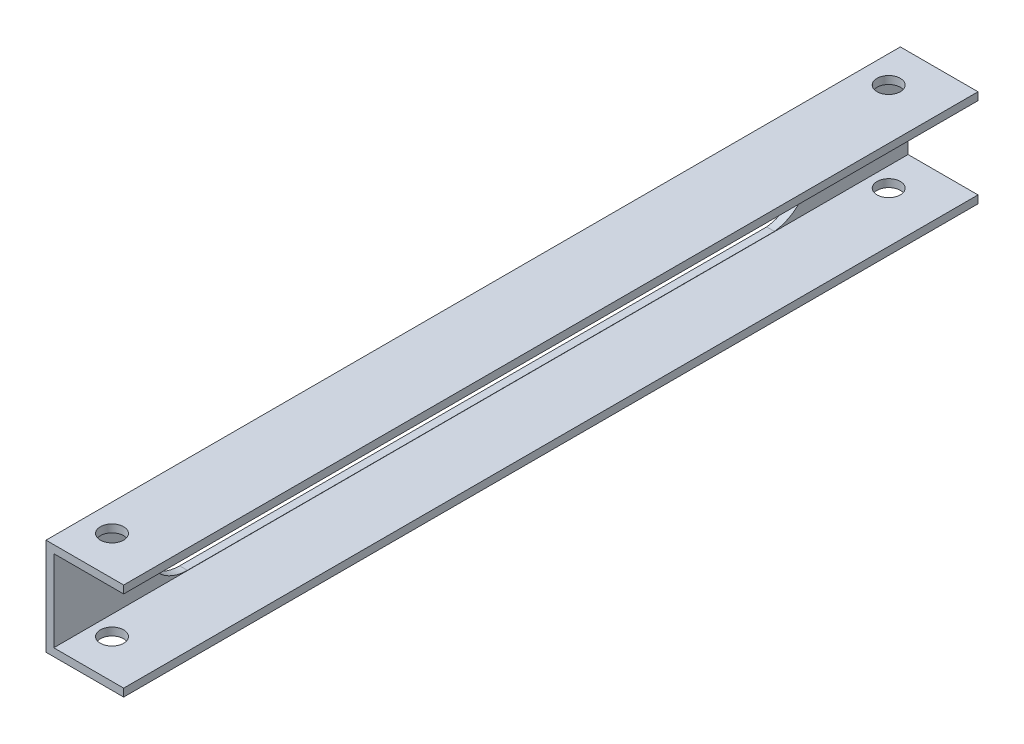
ISO-10303-21;
HEADER;
FILE_DESCRIPTION(('STEP AP214'),'2;1');
FILE_NAME('part.step','',(''),(''),'','','');
FILE_SCHEMA(('AUTOMOTIVE_DESIGN { 1 0 10303 214 1 1 1 1 }'));
ENDSEC;
DATA;
#1=APPLICATION_CONTEXT('core data for automotive mechanical design processes');
#2=APPLICATION_PROTOCOL_DEFINITION('international standard','automotive_design',2000,#1);
#3=PRODUCT_CONTEXT('',#1,'mechanical');
#4=PRODUCT('Part','Part','',(#3));
#5=PRODUCT_RELATED_PRODUCT_CATEGORY('part','',(#4));
#6=PRODUCT_DEFINITION_FORMATION('','',#4);
#7=PRODUCT_DEFINITION_CONTEXT('part definition',#1,'design');
#8=PRODUCT_DEFINITION('design','',#6,#7);
#9=PRODUCT_DEFINITION_SHAPE('','',#8);
#10=(LENGTH_UNIT() NAMED_UNIT(*) SI_UNIT(.MILLI.,.METRE.));
#11=(NAMED_UNIT(*) PLANE_ANGLE_UNIT() SI_UNIT($,.RADIAN.));
#12=(NAMED_UNIT(*) SI_UNIT($,.STERADIAN.) SOLID_ANGLE_UNIT());
#13=UNCERTAINTY_MEASURE_WITH_UNIT(LENGTH_MEASURE(1.E-05),#10,'distance_accuracy_value','');
#14=(GEOMETRIC_REPRESENTATION_CONTEXT(3) GLOBAL_UNCERTAINTY_ASSIGNED_CONTEXT((#13)) GLOBAL_UNIT_ASSIGNED_CONTEXT((#10,
#11,#12)) REPRESENTATION_CONTEXT('',''));
#15=CARTESIAN_POINT('',(0.,0.,0.));
#16=DIRECTION('',(0.,0.,1.));
#17=DIRECTION('',(1.,0.,0.));
#18=AXIS2_PLACEMENT_3D('',#15,#16,#17);
#19=CARTESIAN_POINT('',(-177.703422053232,250.136882129278,220.));
#20=DIRECTION('',(1.,0.,0.));
#21=DIRECTION('',(0.,1.,0.));
#22=AXIS2_PLACEMENT_3D('',#19,#20,#21);
#23=PLANE('',#22);
#24=DIRECTION('',(0.,0.,1.));
#25=VECTOR('',#24,1.);
#26=CARTESIAN_POINT('',(-177.703422053232,227.204144786134,34.4067059057754));
#27=LINE('',#26,#25);
#28=CARTESIAN_POINT('',(-177.703422053232,227.204144786134,34.4067059057754));
#29=VERTEX_POINT('',#28);
#30=CARTESIAN_POINT('',(-177.703422053232,227.204144786134,185.593294094225));
#31=VERTEX_POINT('',#30);
#32=EDGE_CURVE('E155',#29,#31,#27,.T.);
#33=ORIENTED_EDGE('',*,*,#32,.F.);
#34=CARTESIAN_POINT('',(-177.703422053232,237.636882129278,35.5932940942244));
#35=DIRECTION('',(-1.,0.,0.));
#36=DIRECTION('',(0.,-1.,0.));
#37=AXIS2_PLACEMENT_3D('',#34,#35,#36);
#38=CIRCLE('',#37,10.5);
#39=CARTESIAN_POINT('',(-177.703422053232,248.069619472422,34.4067059057756));
#40=VERTEX_POINT('',#39);
#41=EDGE_CURVE('E54',#40,#29,#38,.T.);
#42=ORIENTED_EDGE('',*,*,#41,.F.);
#43=DIRECTION('',(0.,0.,-1.));
#44=VECTOR('',#43,1.);
#45=CARTESIAN_POINT('',(-177.703422053232,248.069619472422,34.4067059057756));
#46=LINE('',#45,#44);
#47=CARTESIAN_POINT('',(-177.703422053232,248.069619472422,185.593294094224));
#48=VERTEX_POINT('',#47);
#49=EDGE_CURVE('E137',#48,#40,#46,.T.);
#50=ORIENTED_EDGE('',*,*,#49,.F.);
#51=CARTESIAN_POINT('',(-177.703422053232,237.636882129278,185.593294094224));
#52=DIRECTION('',(-1.,0.,0.));
#53=DIRECTION('',(0.,-1.,0.));
#54=AXIS2_PLACEMENT_3D('',#51,#52,#53);
#55=CIRCLE('',#54,10.4327373431441);
#56=EDGE_CURVE('E162',#31,#48,#55,.T.);
#57=ORIENTED_EDGE('',*,*,#56,.F.);
#58=EDGE_LOOP('',(#33,#42,#50,#57));
#59=FACE_BOUND('',#58,.T.);
#60=DIRECTION('',(0.,-1.,0.));
#61=VECTOR('',#60,1.);
#62=CARTESIAN_POINT('',(-177.703422053232,250.136882129278,0.));
#63=LINE('',#62,#61);
#64=CARTESIAN_POINT('',(-177.703422053232,250.136882129278,0.));
#65=VERTEX_POINT('',#64);
#66=CARTESIAN_POINT('',(-177.703422053232,225.136882129278,0.));
#67=VERTEX_POINT('',#66);
#68=EDGE_CURVE('E144',#65,#67,#63,.T.);
#69=ORIENTED_EDGE('',*,*,#68,.T.);
#70=DIRECTION('',(0.,0.,-1.));
#71=VECTOR('',#70,1.);
#72=CARTESIAN_POINT('',(-177.703422053232,225.136882129278,220.));
#73=LINE('',#72,#71);
#74=CARTESIAN_POINT('',(-177.703422053232,225.136882129278,220.));
#75=VERTEX_POINT('',#74);
#76=EDGE_CURVE('E11',#75,#67,#73,.T.);
#77=ORIENTED_EDGE('',*,*,#76,.F.);
#78=DIRECTION('',(0.,-1.,0.));
#79=VECTOR('',#78,1.);
#80=CARTESIAN_POINT('',(-177.703422053232,250.136882129278,220.));
#81=LINE('',#80,#79);
#82=CARTESIAN_POINT('',(-177.703422053232,250.136882129278,220.));
#83=VERTEX_POINT('',#82);
#84=EDGE_CURVE('E176',#83,#75,#81,.T.);
#85=ORIENTED_EDGE('',*,*,#84,.F.);
#86=DIRECTION('',(0.,0.,-1.));
#87=VECTOR('',#86,1.);
#88=CARTESIAN_POINT('',(-177.703422053232,250.136882129278,220.));
#89=LINE('',#88,#87);
#90=EDGE_CURVE('E202',#83,#65,#89,.T.);
#91=ORIENTED_EDGE('',*,*,#90,.T.);
#92=EDGE_LOOP('',(#69,#77,#85,#91));
#93=FACE_BOUND('',#92,.T.);
#94=ADVANCED_FACE('F39',(#59,#93),#23,.F.);
#95=CARTESIAN_POINT('',(-177.703422053232,225.136882129278,220.));
#96=DIRECTION('',(0.,1.,0.));
#97=DIRECTION('',(-1.,0.,0.));
#98=AXIS2_PLACEMENT_3D('',#95,#96,#97);
#99=PLANE('',#98);
#100=CARTESIAN_POINT('',(-170.703422053232,225.136882129278,210.));
#101=DIRECTION('',(0.,1.,0.));
#102=DIRECTION('',(-1.,0.,0.));
#103=AXIS2_PLACEMENT_3D('',#100,#101,#102);
#104=CIRCLE('',#103,2.99999999999999);
#105=CARTESIAN_POINT('',(-173.703422053232,225.136882129278,210.));
#106=VERTEX_POINT('',#105);
#107=EDGE_CURVE('E312',#106,#106,#104,.T.);
#108=ORIENTED_EDGE('',*,*,#107,.T.);
#109=EDGE_LOOP('',(#108));
#110=FACE_BOUND('',#109,.T.);
#111=CARTESIAN_POINT('',(-170.703422053232,225.136882129278,9.99999999999998));
#112=DIRECTION('',(0.,1.,0.));
#113=DIRECTION('',(-1.,0.,0.));
#114=AXIS2_PLACEMENT_3D('',#111,#112,#113);
#115=CIRCLE('',#114,2.99999999999999);
#116=CARTESIAN_POINT('',(-173.703422053232,225.136882129278,9.99999999999998));
#117=VERTEX_POINT('',#116);
#118=EDGE_CURVE('E324',#117,#117,#115,.T.);
#119=ORIENTED_EDGE('',*,*,#118,.T.);
#120=EDGE_LOOP('',(#119));
#121=FACE_BOUND('',#120,.T.);
#122=DIRECTION('',(1.,0.,0.));
#123=VECTOR('',#122,1.);
#124=CARTESIAN_POINT('',(-177.703422053232,225.136882129278,0.));
#125=LINE('',#124,#123);
#126=CARTESIAN_POINT('',(-157.703422053232,225.136882129278,0.));
#127=VERTEX_POINT('',#126);
#128=EDGE_CURVE('E206',#67,#127,#125,.T.);
#129=ORIENTED_EDGE('',*,*,#128,.T.);
#130=DIRECTION('',(0.,0.,-1.));
#131=VECTOR('',#130,1.);
#132=CARTESIAN_POINT('',(-157.703422053232,225.136882129278,220.));
#133=LINE('',#132,#131);
#134=CARTESIAN_POINT('',(-157.703422053232,225.136882129278,220.));
#135=VERTEX_POINT('',#134);
#136=EDGE_CURVE('E47',#135,#127,#133,.T.);
#137=ORIENTED_EDGE('',*,*,#136,.F.);
#138=DIRECTION('',(1.,0.,0.));
#139=VECTOR('',#138,1.);
#140=CARTESIAN_POINT('',(-177.703422053232,225.136882129278,220.));
#141=LINE('',#140,#139);
#142=EDGE_CURVE('E180',#75,#135,#141,.T.);
#143=ORIENTED_EDGE('',*,*,#142,.F.);
#144=ORIENTED_EDGE('',*,*,#76,.T.);
#145=EDGE_LOOP('',(#129,#137,#143,#144));
#146=FACE_BOUND('',#145,.T.);
#147=ADVANCED_FACE('F275',(#110,#121,#146),#99,.F.);
#148=CARTESIAN_POINT('',(-157.703422053232,227.136882129278,220.));
#149=DIRECTION('',(-1.,0.,0.));
#150=DIRECTION('',(0.,-1.,0.));
#151=AXIS2_PLACEMENT_3D('',#148,#149,#150);
#152=PLANE('',#151);
#153=DIRECTION('',(0.,1.,0.));
#154=VECTOR('',#153,1.);
#155=CARTESIAN_POINT('',(-157.703422053232,227.136882129278,0.));
#156=LINE('',#155,#154);
#157=CARTESIAN_POINT('',(-157.703422053232,227.136882129278,0.));
#158=VERTEX_POINT('',#157);
#159=EDGE_CURVE('E209',#127,#158,#156,.T.);
#160=ORIENTED_EDGE('',*,*,#159,.T.);
#161=DIRECTION('',(0.,0.,-1.));
#162=VECTOR('',#161,1.);
#163=CARTESIAN_POINT('',(-157.703422053232,227.136882129278,220.));
#164=LINE('',#163,#162);
#165=CARTESIAN_POINT('',(-157.703422053232,227.136882129278,220.));
#166=VERTEX_POINT('',#165);
#167=EDGE_CURVE('E245',#166,#158,#164,.T.);
#168=ORIENTED_EDGE('',*,*,#167,.F.);
#169=DIRECTION('',(0.,1.,0.));
#170=VECTOR('',#169,1.);
#171=CARTESIAN_POINT('',(-157.703422053232,227.136882129278,220.));
#172=LINE('',#171,#170);
#173=EDGE_CURVE('E184',#135,#166,#172,.T.);
#174=ORIENTED_EDGE('',*,*,#173,.F.);
#175=ORIENTED_EDGE('',*,*,#136,.T.);
#176=EDGE_LOOP('',(#160,#168,#174,#175));
#177=FACE_BOUND('',#176,.T.);
#178=ADVANCED_FACE('F254',(#177),#152,.F.);
#179=CARTESIAN_POINT('',(-157.703422053232,227.136882129278,220.));
#180=DIRECTION('',(0.,-1.,0.));
#181=DIRECTION('',(0.,0.,-1.));
#182=AXIS2_PLACEMENT_3D('',#179,#180,#181);
#183=PLANE('',#182);
#184=CARTESIAN_POINT('',(-170.703422053232,227.136882129278,210.));
#185=DIRECTION('',(0.,-1.,0.));
#186=DIRECTION('',(0.,0.,-1.));
#187=AXIS2_PLACEMENT_3D('',#184,#185,#186);
#188=CIRCLE('',#187,2.99999999999999);
#189=CARTESIAN_POINT('',(-170.703422053232,227.136882129278,207.));
#190=VERTEX_POINT('',#189);
#191=EDGE_CURVE('E315',#190,#190,#188,.T.);
#192=ORIENTED_EDGE('',*,*,#191,.T.);
#193=EDGE_LOOP('',(#192));
#194=FACE_BOUND('',#193,.T.);
#195=CARTESIAN_POINT('',(-170.703422053232,227.136882129278,9.99999999999998));
#196=DIRECTION('',(0.,-1.,0.));
#197=DIRECTION('',(0.,0.,-1.));
#198=AXIS2_PLACEMENT_3D('',#195,#196,#197);
#199=CIRCLE('',#198,2.99999999999999);
#200=CARTESIAN_POINT('',(-170.703422053232,227.136882129278,6.99999999999999));
#201=VERTEX_POINT('',#200);
#202=EDGE_CURVE('E328',#201,#201,#199,.T.);
#203=ORIENTED_EDGE('',*,*,#202,.T.);
#204=EDGE_LOOP('',(#203));
#205=FACE_BOUND('',#204,.T.);
#206=DIRECTION('',(-1.,0.,0.));
#207=VECTOR('',#206,1.);
#208=CARTESIAN_POINT('',(-157.703422053232,227.136882129278,0.));
#209=LINE('',#208,#207);
#210=CARTESIAN_POINT('',(-175.703422053232,227.136882129278,0.));
#211=VERTEX_POINT('',#210);
#212=EDGE_CURVE('E212',#158,#211,#209,.T.);
#213=ORIENTED_EDGE('',*,*,#212,.T.);
#214=DIRECTION('',(0.,0.,-1.));
#215=VECTOR('',#214,1.);
#216=CARTESIAN_POINT('',(-175.703422053232,227.136882129278,220.));
#217=LINE('',#216,#215);
#218=CARTESIAN_POINT('',(-175.703422053232,227.136882129278,220.));
#219=VERTEX_POINT('',#218);
#220=EDGE_CURVE('E241',#219,#211,#217,.T.);
#221=ORIENTED_EDGE('',*,*,#220,.F.);
#222=DIRECTION('',(-1.,0.,0.));
#223=VECTOR('',#222,1.);
#224=CARTESIAN_POINT('',(-157.703422053232,227.136882129278,220.));
#225=LINE('',#224,#223);
#226=EDGE_CURVE('E187',#166,#219,#225,.T.);
#227=ORIENTED_EDGE('',*,*,#226,.F.);
#228=ORIENTED_EDGE('',*,*,#167,.T.);
#229=EDGE_LOOP('',(#213,#221,#227,#228));
#230=FACE_BOUND('',#229,.T.);
#231=ADVANCED_FACE('F265',(#194,#205,#230),#183,.F.);
#232=CARTESIAN_POINT('',(-175.703422053232,248.136882129278,220.));
#233=DIRECTION('',(-1.,0.,0.));
#234=DIRECTION('',(0.,0.,1.));
#235=AXIS2_PLACEMENT_3D('',#232,#233,#234);
#236=PLANE('',#235);
#237=DIRECTION('',(0.,0.,1.));
#238=VECTOR('',#237,1.);
#239=CARTESIAN_POINT('',(-175.703422053232,248.069619472422,34.4067059057756));
#240=LINE('',#239,#238);
#241=CARTESIAN_POINT('',(-175.703422053232,248.069619472422,34.4067059057756));
#242=VERTEX_POINT('',#241);
#243=CARTESIAN_POINT('',(-175.703422053232,248.069619472422,185.593294094224));
#244=VERTEX_POINT('',#243);
#245=EDGE_CURVE('E150',#242,#244,#240,.T.);
#246=ORIENTED_EDGE('',*,*,#245,.F.);
#247=CARTESIAN_POINT('',(-175.703422053232,237.636882129278,35.5932940942244));
#248=DIRECTION('',(-1.,0.,0.));
#249=DIRECTION('',(0.,0.,1.));
#250=AXIS2_PLACEMENT_3D('',#247,#248,#249);
#251=CIRCLE('',#250,10.5);
#252=CARTESIAN_POINT('',(-175.703422053232,227.204144786134,34.4067059057754));
#253=VERTEX_POINT('',#252);
#254=EDGE_CURVE('E130',#253,#242,#251,.F.);
#255=ORIENTED_EDGE('',*,*,#254,.F.);
#256=DIRECTION('',(0.,0.,-1.));
#257=VECTOR('',#256,1.);
#258=CARTESIAN_POINT('',(-175.703422053232,227.204144786134,34.4067059057754));
#259=LINE('',#258,#257);
#260=CARTESIAN_POINT('',(-175.703422053232,227.204144786134,185.593294094225));
#261=VERTEX_POINT('',#260);
#262=EDGE_CURVE('E140',#261,#253,#259,.T.);
#263=ORIENTED_EDGE('',*,*,#262,.F.);
#264=CARTESIAN_POINT('',(-175.703422053232,237.636882129278,185.593294094224));
#265=DIRECTION('',(-1.,0.,0.));
#266=DIRECTION('',(0.,0.,1.));
#267=AXIS2_PLACEMENT_3D('',#264,#265,#266);
#268=CIRCLE('',#267,10.4327373431441);
#269=EDGE_CURVE('E62',#244,#261,#268,.F.);
#270=ORIENTED_EDGE('',*,*,#269,.F.);
#271=EDGE_LOOP('',(#246,#255,#263,#270));
#272=FACE_BOUND('',#271,.T.);
#273=DIRECTION('',(0.,1.,0.));
#274=VECTOR('',#273,1.);
#275=CARTESIAN_POINT('',(-175.703422053232,248.136882129278,0.));
#276=LINE('',#275,#274);
#277=CARTESIAN_POINT('',(-175.703422053232,248.136882129278,0.));
#278=VERTEX_POINT('',#277);
#279=EDGE_CURVE('E215',#211,#278,#276,.T.);
#280=ORIENTED_EDGE('',*,*,#279,.T.);
#281=DIRECTION('',(0.,0.,-1.));
#282=VECTOR('',#281,1.);
#283=CARTESIAN_POINT('',(-175.703422053232,248.136882129278,220.));
#284=LINE('',#283,#282);
#285=CARTESIAN_POINT('',(-175.703422053232,248.136882129278,220.));
#286=VERTEX_POINT('',#285);
#287=EDGE_CURVE('E237',#286,#278,#284,.T.);
#288=ORIENTED_EDGE('',*,*,#287,.F.);
#289=DIRECTION('',(0.,1.,0.));
#290=VECTOR('',#289,1.);
#291=CARTESIAN_POINT('',(-175.703422053232,248.136882129278,220.));
#292=LINE('',#291,#290);
#293=EDGE_CURVE('E190',#219,#286,#292,.T.);
#294=ORIENTED_EDGE('',*,*,#293,.F.);
#295=ORIENTED_EDGE('',*,*,#220,.T.);
#296=EDGE_LOOP('',(#280,#288,#294,#295));
#297=FACE_BOUND('',#296,.T.);
#298=ADVANCED_FACE('F147',(#272,#297),#236,.F.);
#299=CARTESIAN_POINT('',(-157.703422053232,248.136882129278,220.));
#300=DIRECTION('',(0.,1.,0.));
#301=DIRECTION('',(0.,0.,1.));
#302=AXIS2_PLACEMENT_3D('',#299,#300,#301);
#303=PLANE('',#302);
#304=CARTESIAN_POINT('',(-170.703422053232,248.136882129278,210.));
#305=DIRECTION('',(0.,1.,0.));
#306=DIRECTION('',(0.,0.,1.));
#307=AXIS2_PLACEMENT_3D('',#304,#305,#306);
#308=CIRCLE('',#307,2.99999999999999);
#309=CARTESIAN_POINT('',(-170.703422053232,248.136882129278,213.));
#310=VERTEX_POINT('',#309);
#311=EDGE_CURVE('E321',#310,#310,#308,.T.);
#312=ORIENTED_EDGE('',*,*,#311,.T.);
#313=EDGE_LOOP('',(#312));
#314=FACE_BOUND('',#313,.T.);
#315=CARTESIAN_POINT('',(-170.703422053232,248.136882129278,9.99999999999998));
#316=DIRECTION('',(0.,1.,0.));
#317=DIRECTION('',(0.,0.,1.));
#318=AXIS2_PLACEMENT_3D('',#315,#316,#317);
#319=CIRCLE('',#318,2.99999999999999);
#320=CARTESIAN_POINT('',(-170.703422053232,248.136882129278,13.));
#321=VERTEX_POINT('',#320);
#322=EDGE_CURVE('E332',#321,#321,#319,.T.);
#323=ORIENTED_EDGE('',*,*,#322,.T.);
#324=EDGE_LOOP('',(#323));
#325=FACE_BOUND('',#324,.T.);
#326=DIRECTION('',(1.,0.,0.));
#327=VECTOR('',#326,1.);
#328=CARTESIAN_POINT('',(-157.703422053232,248.136882129278,0.));
#329=LINE('',#328,#327);
#330=CARTESIAN_POINT('',(-157.703422053232,248.136882129278,0.));
#331=VERTEX_POINT('',#330);
#332=EDGE_CURVE('E218',#278,#331,#329,.T.);
#333=ORIENTED_EDGE('',*,*,#332,.T.);
#334=DIRECTION('',(0.,0.,-1.));
#335=VECTOR('',#334,1.);
#336=CARTESIAN_POINT('',(-157.703422053232,248.136882129278,220.));
#337=LINE('',#336,#335);
#338=CARTESIAN_POINT('',(-157.703422053232,248.136882129278,220.));
#339=VERTEX_POINT('',#338);
#340=EDGE_CURVE('E233',#339,#331,#337,.T.);
#341=ORIENTED_EDGE('',*,*,#340,.F.);
#342=DIRECTION('',(1.,0.,0.));
#343=VECTOR('',#342,1.);
#344=CARTESIAN_POINT('',(-157.703422053232,248.136882129278,220.));
#345=LINE('',#344,#343);
#346=EDGE_CURVE('E193',#286,#339,#345,.T.);
#347=ORIENTED_EDGE('',*,*,#346,.F.);
#348=ORIENTED_EDGE('',*,*,#287,.T.);
#349=EDGE_LOOP('',(#333,#341,#347,#348));
#350=FACE_BOUND('',#349,.T.);
#351=ADVANCED_FACE('F288',(#314,#325,#350),#303,.F.);
#352=CARTESIAN_POINT('',(-157.703422053232,250.136882129278,220.));
#353=DIRECTION('',(-1.,0.,0.));
#354=DIRECTION('',(0.,0.,1.));
#355=AXIS2_PLACEMENT_3D('',#352,#353,#354);
#356=PLANE('',#355);
#357=DIRECTION('',(0.,1.,0.));
#358=VECTOR('',#357,1.);
#359=CARTESIAN_POINT('',(-157.703422053232,250.136882129278,0.));
#360=LINE('',#359,#358);
#361=CARTESIAN_POINT('',(-157.703422053232,250.136882129278,0.));
#362=VERTEX_POINT('',#361);
#363=EDGE_CURVE('E221',#331,#362,#360,.T.);
#364=ORIENTED_EDGE('',*,*,#363,.T.);
#365=DIRECTION('',(0.,0.,-1.));
#366=VECTOR('',#365,1.);
#367=CARTESIAN_POINT('',(-157.703422053232,250.136882129278,220.));
#368=LINE('',#367,#366);
#369=CARTESIAN_POINT('',(-157.703422053232,250.136882129278,220.));
#370=VERTEX_POINT('',#369);
#371=EDGE_CURVE('E229',#370,#362,#368,.T.);
#372=ORIENTED_EDGE('',*,*,#371,.F.);
#373=DIRECTION('',(0.,1.,0.));
#374=VECTOR('',#373,1.);
#375=CARTESIAN_POINT('',(-157.703422053232,250.136882129278,220.));
#376=LINE('',#375,#374);
#377=EDGE_CURVE('E196',#339,#370,#376,.T.);
#378=ORIENTED_EDGE('',*,*,#377,.F.);
#379=ORIENTED_EDGE('',*,*,#340,.T.);
#380=EDGE_LOOP('',(#364,#372,#378,#379));
#381=FACE_BOUND('',#380,.T.);
#382=ADVANCED_FACE('F286',(#381),#356,.F.);
#383=CARTESIAN_POINT('',(-177.703422053232,250.136882129278,220.));
#384=DIRECTION('',(0.,-1.,0.));
#385=DIRECTION('',(0.,0.,-1.));
#386=AXIS2_PLACEMENT_3D('',#383,#384,#385);
#387=PLANE('',#386);
#388=CARTESIAN_POINT('',(-170.703422053232,250.136882129278,210.));
#389=DIRECTION('',(0.,1.,0.));
#390=DIRECTION('',(0.,0.,1.));
#391=AXIS2_PLACEMENT_3D('',#388,#389,#390);
#392=CIRCLE('',#391,2.99999999999999);
#393=CARTESIAN_POINT('',(-170.703422053232,250.136882129278,213.));
#394=VERTEX_POINT('',#393);
#395=EDGE_CURVE('E336',#394,#394,#392,.T.);
#396=ORIENTED_EDGE('',*,*,#395,.F.);
#397=EDGE_LOOP('',(#396));
#398=FACE_BOUND('',#397,.T.);
#399=CARTESIAN_POINT('',(-170.703422053232,250.136882129278,9.99999999999998));
#400=DIRECTION('',(0.,1.,0.));
#401=DIRECTION('',(0.,0.,1.));
#402=AXIS2_PLACEMENT_3D('',#399,#400,#401);
#403=CIRCLE('',#402,2.99999999999999);
#404=CARTESIAN_POINT('',(-170.703422053232,250.136882129278,13.));
#405=VERTEX_POINT('',#404);
#406=EDGE_CURVE('E337',#405,#405,#403,.T.);
#407=ORIENTED_EDGE('',*,*,#406,.F.);
#408=EDGE_LOOP('',(#407));
#409=FACE_BOUND('',#408,.T.);
#410=DIRECTION('',(-1.,0.,0.));
#411=VECTOR('',#410,1.);
#412=CARTESIAN_POINT('',(-177.703422053232,250.136882129278,0.));
#413=LINE('',#412,#411);
#414=EDGE_CURVE('E181',#362,#65,#413,.T.);
#415=ORIENTED_EDGE('',*,*,#414,.T.);
#416=ORIENTED_EDGE('',*,*,#90,.F.);
#417=DIRECTION('',(-1.,0.,0.));
#418=VECTOR('',#417,1.);
#419=CARTESIAN_POINT('',(-177.703422053232,250.136882129278,220.));
#420=LINE('',#419,#418);
#421=EDGE_CURVE('E199',#370,#83,#420,.T.);
#422=ORIENTED_EDGE('',*,*,#421,.F.);
#423=ORIENTED_EDGE('',*,*,#371,.T.);
#424=EDGE_LOOP('',(#415,#416,#422,#423));
#425=FACE_BOUND('',#424,.T.);
#426=ADVANCED_FACE('F281',(#398,#409,#425),#387,.F.);
#427=CARTESIAN_POINT('',(0.,0.,220.));
#428=DIRECTION('',(0.,0.,1.));
#429=DIRECTION('',(1.,0.,0.));
#430=AXIS2_PLACEMENT_3D('',#427,#428,#429);
#431=PLANE('',#430);
#432=ORIENTED_EDGE('',*,*,#84,.T.);
#433=ORIENTED_EDGE('',*,*,#142,.T.);
#434=ORIENTED_EDGE('',*,*,#173,.T.);
#435=ORIENTED_EDGE('',*,*,#226,.T.);
#436=ORIENTED_EDGE('',*,*,#293,.T.);
#437=ORIENTED_EDGE('',*,*,#346,.T.);
#438=ORIENTED_EDGE('',*,*,#377,.T.);
#439=ORIENTED_EDGE('',*,*,#421,.T.);
#440=EDGE_LOOP('',(#432,#433,#434,#435,#436,#437,#438,#439));
#441=FACE_BOUND('',#440,.T.);
#442=ADVANCED_FACE('F271',(#441),#431,.T.);
#443=CARTESIAN_POINT('',(0.,0.,0.));
#444=DIRECTION('',(0.,0.,1.));
#445=DIRECTION('',(1.,0.,0.));
#446=AXIS2_PLACEMENT_3D('',#443,#444,#445);
#447=PLANE('',#446);
#448=ORIENTED_EDGE('',*,*,#68,.F.);
#449=ORIENTED_EDGE('',*,*,#414,.F.);
#450=ORIENTED_EDGE('',*,*,#363,.F.);
#451=ORIENTED_EDGE('',*,*,#332,.F.);
#452=ORIENTED_EDGE('',*,*,#279,.F.);
#453=ORIENTED_EDGE('',*,*,#212,.F.);
#454=ORIENTED_EDGE('',*,*,#159,.F.);
#455=ORIENTED_EDGE('',*,*,#128,.F.);
#456=EDGE_LOOP('',(#448,#449,#450,#451,#452,#453,#454,#455));
#457=FACE_BOUND('',#456,.T.);
#458=ADVANCED_FACE('F260',(#457),#447,.F.);
#459=CARTESIAN_POINT('',(-157.702422053232,237.636882129278,35.5932940942244));
#460=DIRECTION('',(-1.,0.,0.));
#461=DIRECTION('',(0.,-1.,0.));
#462=AXIS2_PLACEMENT_3D('',#459,#460,#461);
#463=CYLINDRICAL_SURFACE('',#462,10.5);
#464=ORIENTED_EDGE('',*,*,#254,.T.);
#465=DIRECTION('',(-1.,0.,0.));
#466=VECTOR('',#465,1.);
#467=CARTESIAN_POINT('',(-157.702422053232,248.069619472422,34.4067059057756));
#468=LINE('',#467,#466);
#469=EDGE_CURVE('E145',#242,#40,#468,.T.);
#470=ORIENTED_EDGE('',*,*,#469,.T.);
#471=ORIENTED_EDGE('',*,*,#41,.T.);
#472=DIRECTION('',(-1.,0.,0.));
#473=VECTOR('',#472,1.);
#474=CARTESIAN_POINT('',(-157.702422053232,227.204144786133,34.4067059057754));
#475=LINE('',#474,#473);
#476=EDGE_CURVE('E126',#253,#29,#475,.T.);
#477=ORIENTED_EDGE('',*,*,#476,.F.);
#478=EDGE_LOOP('',(#464,#470,#471,#477));
#479=FACE_BOUND('',#478,.T.);
#480=ADVANCED_FACE('F128',(#479),#463,.F.);
#481=CARTESIAN_POINT('',(-157.702422053232,248.069619472422,34.4067059057756));
#482=DIRECTION('',(0.,1.,0.));
#483=DIRECTION('',(-1.,0.,0.));
#484=AXIS2_PLACEMENT_3D('',#481,#482,#483);
#485=PLANE('',#484);
#486=ORIENTED_EDGE('',*,*,#245,.T.);
#487=DIRECTION('',(-1.,0.,0.));
#488=VECTOR('',#487,1.);
#489=CARTESIAN_POINT('',(-157.702422053232,248.069619472422,185.593294094224));
#490=LINE('',#489,#488);
#491=EDGE_CURVE('E171',#244,#48,#490,.T.);
#492=ORIENTED_EDGE('',*,*,#491,.T.);
#493=ORIENTED_EDGE('',*,*,#49,.T.);
#494=ORIENTED_EDGE('',*,*,#469,.F.);
#495=EDGE_LOOP('',(#486,#492,#493,#494));
#496=FACE_BOUND('',#495,.T.);
#497=ADVANCED_FACE('F310',(#496),#485,.F.);
#498=CARTESIAN_POINT('',(-157.702422053232,237.636882129278,185.593294094224));
#499=DIRECTION('',(-1.,0.,0.));
#500=DIRECTION('',(0.,-1.,0.));
#501=AXIS2_PLACEMENT_3D('',#498,#499,#500);
#502=CYLINDRICAL_SURFACE('',#501,10.4327373431441);
#503=ORIENTED_EDGE('',*,*,#269,.T.);
#504=DIRECTION('',(-1.,0.,0.));
#505=VECTOR('',#504,1.);
#506=CARTESIAN_POINT('',(-157.702422053232,227.204144786133,185.593294094225));
#507=LINE('',#506,#505);
#508=EDGE_CURVE('E136',#261,#31,#507,.T.);
#509=ORIENTED_EDGE('',*,*,#508,.T.);
#510=ORIENTED_EDGE('',*,*,#56,.T.);
#511=ORIENTED_EDGE('',*,*,#491,.F.);
#512=EDGE_LOOP('',(#503,#509,#510,#511));
#513=FACE_BOUND('',#512,.T.);
#514=ADVANCED_FACE('F308',(#513),#502,.F.);
#515=CARTESIAN_POINT('',(-157.702422053232,227.204144786133,34.4067059057754));
#516=DIRECTION('',(0.,-1.,0.));
#517=DIRECTION('',(1.,0.,0.));
#518=AXIS2_PLACEMENT_3D('',#515,#516,#517);
#519=PLANE('',#518);
#520=ORIENTED_EDGE('',*,*,#262,.T.);
#521=ORIENTED_EDGE('',*,*,#476,.T.);
#522=ORIENTED_EDGE('',*,*,#32,.T.);
#523=ORIENTED_EDGE('',*,*,#508,.F.);
#524=EDGE_LOOP('',(#520,#521,#522,#523));
#525=FACE_BOUND('',#524,.T.);
#526=ADVANCED_FACE('F141',(#525),#519,.F.);
#527=CARTESIAN_POINT('',(-170.703422053232,30.1368821292776,9.99999999999998));
#528=DIRECTION('',(0.,1.,0.));
#529=DIRECTION('',(0.,0.,1.));
#530=AXIS2_PLACEMENT_3D('',#527,#528,#529);
#531=CYLINDRICAL_SURFACE('',#530,2.99999999999999);
#532=ORIENTED_EDGE('',*,*,#406,.T.);
#533=EDGE_LOOP('',(#532));
#534=FACE_BOUND('',#533,.T.);
#535=ORIENTED_EDGE('',*,*,#322,.F.);
#536=EDGE_LOOP('',(#535));
#537=FACE_BOUND('',#536,.T.);
#538=ADVANCED_FACE('F353',(#534,#537),#531,.F.);
#539=CARTESIAN_POINT('',(-170.703422053232,30.1368821292776,210.));
#540=DIRECTION('',(0.,1.,0.));
#541=DIRECTION('',(0.,0.,1.));
#542=AXIS2_PLACEMENT_3D('',#539,#540,#541);
#543=CYLINDRICAL_SURFACE('',#542,2.99999999999999);
#544=ORIENTED_EDGE('',*,*,#395,.T.);
#545=EDGE_LOOP('',(#544));
#546=FACE_BOUND('',#545,.T.);
#547=ORIENTED_EDGE('',*,*,#311,.F.);
#548=EDGE_LOOP('',(#547));
#549=FACE_BOUND('',#548,.T.);
#550=ADVANCED_FACE('F345',(#546,#549),#543,.F.);
#551=ORIENTED_EDGE('',*,*,#202,.F.);
#552=EDGE_LOOP('',(#551));
#553=FACE_BOUND('',#552,.T.);
#554=ORIENTED_EDGE('',*,*,#118,.F.);
#555=EDGE_LOOP('',(#554));
#556=FACE_BOUND('',#555,.T.);
#557=ADVANCED_FACE('F357',(#553,#556),#531,.F.);
#558=ORIENTED_EDGE('',*,*,#191,.F.);
#559=EDGE_LOOP('',(#558));
#560=FACE_BOUND('',#559,.T.);
#561=ORIENTED_EDGE('',*,*,#107,.F.);
#562=EDGE_LOOP('',(#561));
#563=FACE_BOUND('',#562,.T.);
#564=ADVANCED_FACE('F364',(#560,#563),#543,.F.);
#565=CLOSED_SHELL('',(#94,#147,#178,#231,#298,#351,#382,#426,#442,#458,#480,#497,#514,#526,#538,
#550,#557,#564));
#566=MANIFOLD_SOLID_BREP('B2',#565);
#567=ADVANCED_BREP_SHAPE_REPRESENTATION('',(#18,#566),#14);
#568=SHAPE_DEFINITION_REPRESENTATION(#9,#567);
ENDSEC;
END-ISO-10303-21;
